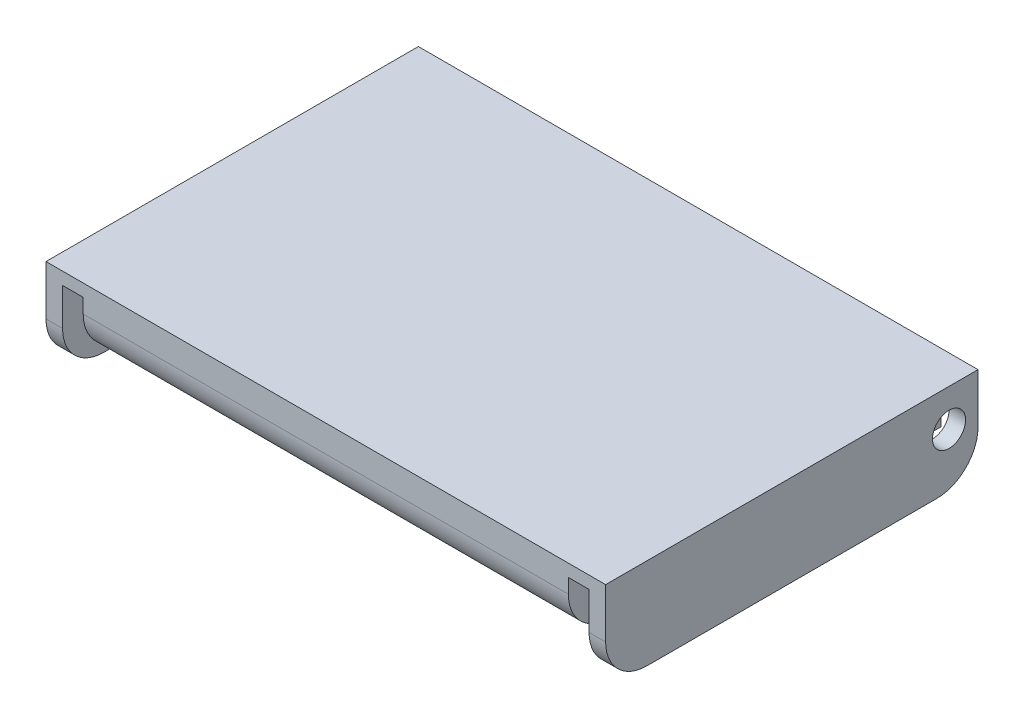
ISO-10303-21;
HEADER;
FILE_DESCRIPTION(('STEP AP214'),'2;1');
FILE_NAME('part.step','',(''),(''),'','','');
FILE_SCHEMA(('AUTOMOTIVE_DESIGN { 1 0 10303 214 1 1 1 1 }'));
ENDSEC;
DATA;
#1=APPLICATION_CONTEXT('core data for automotive mechanical design processes');
#2=APPLICATION_PROTOCOL_DEFINITION('international standard','automotive_design',2000,#1);
#3=PRODUCT_CONTEXT('',#1,'mechanical');
#4=PRODUCT('Part','Part','',(#3));
#5=PRODUCT_RELATED_PRODUCT_CATEGORY('part','',(#4));
#6=PRODUCT_DEFINITION_FORMATION('','',#4);
#7=PRODUCT_DEFINITION_CONTEXT('part definition',#1,'design');
#8=PRODUCT_DEFINITION('design','',#6,#7);
#9=PRODUCT_DEFINITION_SHAPE('','',#8);
#10=(LENGTH_UNIT() NAMED_UNIT(*) SI_UNIT(.MILLI.,.METRE.));
#11=(NAMED_UNIT(*) PLANE_ANGLE_UNIT() SI_UNIT($,.RADIAN.));
#12=(NAMED_UNIT(*) SI_UNIT($,.STERADIAN.) SOLID_ANGLE_UNIT());
#13=UNCERTAINTY_MEASURE_WITH_UNIT(LENGTH_MEASURE(1.E-05),#10,'distance_accuracy_value','');
#14=(GEOMETRIC_REPRESENTATION_CONTEXT(3) GLOBAL_UNCERTAINTY_ASSIGNED_CONTEXT((#13)) GLOBAL_UNIT_ASSIGNED_CONTEXT((#10,
#11,#12)) REPRESENTATION_CONTEXT('',''));
#15=CARTESIAN_POINT('',(0.,0.,0.));
#16=DIRECTION('',(0.,0.,1.));
#17=DIRECTION('',(1.,0.,0.));
#18=AXIS2_PLACEMENT_3D('',#15,#16,#17);
#19=CARTESIAN_POINT('',(0.,10.,-35.));
#20=DIRECTION('',(-1.,0.,0.));
#21=DIRECTION('',(0.,0.,1.));
#22=AXIS2_PLACEMENT_3D('',#19,#20,#21);
#23=CYLINDRICAL_SURFACE('',#22,10.);
#24=CARTESIAN_POINT('',(63.625,10.,-35.));
#25=DIRECTION('',(1.,0.,0.));
#26=DIRECTION('',(0.,0.,-1.));
#27=AXIS2_PLACEMENT_3D('',#24,#25,#26);
#28=CIRCLE('',#27,10.);
#29=CARTESIAN_POINT('',(63.625,10.,-45.));
#30=VERTEX_POINT('',#29);
#31=CARTESIAN_POINT('',(63.625,0.,-35.));
#32=VERTEX_POINT('',#31);
#33=EDGE_CURVE('E334',#30,#32,#28,.F.);
#34=ORIENTED_EDGE('',*,*,#33,.F.);
#35=DIRECTION('',(1.,0.,0.));
#36=VECTOR('',#35,1.);
#37=CARTESIAN_POINT('',(0.,10.,-45.));
#38=LINE('',#37,#36);
#39=CARTESIAN_POINT('',(67.625,10.,-45.));
#40=VERTEX_POINT('',#39);
#41=EDGE_CURVE('E48',#40,#30,#38,.F.);
#42=ORIENTED_EDGE('',*,*,#41,.F.);
#43=CARTESIAN_POINT('',(67.625,10.,-35.));
#44=DIRECTION('',(-1.,0.,0.));
#45=DIRECTION('',(0.,0.,1.));
#46=AXIS2_PLACEMENT_3D('',#43,#44,#45);
#47=CIRCLE('',#46,10.);
#48=CARTESIAN_POINT('',(67.625,0.,-35.));
#49=VERTEX_POINT('',#48);
#50=EDGE_CURVE('E11',#49,#40,#47,.F.);
#51=ORIENTED_EDGE('',*,*,#50,.F.);
#52=DIRECTION('',(1.,0.,0.));
#53=VECTOR('',#52,1.);
#54=CARTESIAN_POINT('',(0.,0.,-35.));
#55=LINE('',#54,#53);
#56=EDGE_CURVE('E338',#32,#49,#55,.T.);
#57=ORIENTED_EDGE('',*,*,#56,.F.);
#58=EDGE_LOOP('',(#34,#42,#51,#57));
#59=FACE_BOUND('',#58,.T.);
#60=ADVANCED_FACE('F39',(#59),#23,.T.);
#61=CARTESIAN_POINT('',(0.,10.,-35.));
#62=DIRECTION('',(-1.,0.,0.));
#63=DIRECTION('',(0.,0.,1.));
#64=AXIS2_PLACEMENT_3D('',#61,#62,#63);
#65=CYLINDRICAL_SURFACE('',#64,10.);
#66=DIRECTION('',(1.,0.,0.));
#67=VECTOR('',#66,1.);
#68=CARTESIAN_POINT('',(0.,0.,-35.));
#69=LINE('',#68,#67);
#70=CARTESIAN_POINT('',(-67.625,0.,-35.));
#71=VERTEX_POINT('',#70);
#72=CARTESIAN_POINT('',(-63.625,0.,-35.));
#73=VERTEX_POINT('',#72);
#74=EDGE_CURVE('E319',#71,#73,#69,.T.);
#75=ORIENTED_EDGE('',*,*,#74,.F.);
#76=CARTESIAN_POINT('',(-67.625,10.,-35.));
#77=DIRECTION('',(1.,0.,0.));
#78=DIRECTION('',(0.,0.,-1.));
#79=AXIS2_PLACEMENT_3D('',#76,#77,#78);
#80=CIRCLE('',#79,10.);
#81=CARTESIAN_POINT('',(-67.625,10.,-45.));
#82=VERTEX_POINT('',#81);
#83=EDGE_CURVE('E331',#82,#71,#80,.F.);
#84=ORIENTED_EDGE('',*,*,#83,.F.);
#85=DIRECTION('',(1.,0.,0.));
#86=VECTOR('',#85,1.);
#87=CARTESIAN_POINT('',(0.,10.,-45.));
#88=LINE('',#87,#86);
#89=CARTESIAN_POINT('',(-63.625,10.,-45.));
#90=VERTEX_POINT('',#89);
#91=EDGE_CURVE('E327',#90,#82,#88,.F.);
#92=ORIENTED_EDGE('',*,*,#91,.F.);
#93=CARTESIAN_POINT('',(-63.625,10.,-35.));
#94=DIRECTION('',(-1.,0.,0.));
#95=DIRECTION('',(0.,0.,1.));
#96=AXIS2_PLACEMENT_3D('',#93,#94,#95);
#97=CIRCLE('',#96,10.);
#98=EDGE_CURVE('E323',#73,#90,#97,.F.);
#99=ORIENTED_EDGE('',*,*,#98,.F.);
#100=EDGE_LOOP('',(#75,#84,#92,#99));
#101=FACE_BOUND('',#100,.T.);
#102=ADVANCED_FACE('F403',(#101),#65,.T.);
#103=CARTESIAN_POINT('',(0.,10.,35.));
#104=DIRECTION('',(1.,0.,0.));
#105=DIRECTION('',(0.,0.,-1.));
#106=AXIS2_PLACEMENT_3D('',#103,#104,#105);
#107=CYLINDRICAL_SURFACE('',#106,10.);
#108=DIRECTION('',(-1.,0.,0.));
#109=VECTOR('',#108,1.);
#110=CARTESIAN_POINT('',(0.,0.,35.));
#111=LINE('',#110,#109);
#112=CARTESIAN_POINT('',(67.625,0.,35.));
#113=VERTEX_POINT('',#112);
#114=CARTESIAN_POINT('',(63.625,0.,35.));
#115=VERTEX_POINT('',#114);
#116=EDGE_CURVE('E305',#113,#115,#111,.T.);
#117=ORIENTED_EDGE('',*,*,#116,.F.);
#118=CARTESIAN_POINT('',(67.625,10.,35.));
#119=DIRECTION('',(-1.,0.,0.));
#120=DIRECTION('',(0.,0.,1.));
#121=AXIS2_PLACEMENT_3D('',#118,#119,#120);
#122=CIRCLE('',#121,10.);
#123=CARTESIAN_POINT('',(67.625,10.,45.));
#124=VERTEX_POINT('',#123);
#125=EDGE_CURVE('E313',#124,#113,#122,.F.);
#126=ORIENTED_EDGE('',*,*,#125,.F.);
#127=DIRECTION('',(-1.,0.,0.));
#128=VECTOR('',#127,1.);
#129=CARTESIAN_POINT('',(0.,10.,45.));
#130=LINE('',#129,#128);
#131=CARTESIAN_POINT('',(63.625,10.,45.));
#132=VERTEX_POINT('',#131);
#133=EDGE_CURVE('E309',#132,#124,#130,.F.);
#134=ORIENTED_EDGE('',*,*,#133,.F.);
#135=CARTESIAN_POINT('',(63.625,10.,35.));
#136=DIRECTION('',(1.,0.,0.));
#137=DIRECTION('',(0.,0.,-1.));
#138=AXIS2_PLACEMENT_3D('',#135,#136,#137);
#139=CIRCLE('',#138,10.);
#140=EDGE_CURVE('E316',#115,#132,#139,.F.);
#141=ORIENTED_EDGE('',*,*,#140,.F.);
#142=EDGE_LOOP('',(#117,#126,#134,#141));
#143=FACE_BOUND('',#142,.T.);
#144=ADVANCED_FACE('F407',(#143),#107,.T.);
#145=CARTESIAN_POINT('',(0.,10.,35.));
#146=DIRECTION('',(1.,0.,0.));
#147=DIRECTION('',(0.,0.,-1.));
#148=AXIS2_PLACEMENT_3D('',#145,#146,#147);
#149=CYLINDRICAL_SURFACE('',#148,10.);
#150=CARTESIAN_POINT('',(-63.625,10.,35.));
#151=DIRECTION('',(-1.,0.,0.));
#152=DIRECTION('',(0.,0.,1.));
#153=AXIS2_PLACEMENT_3D('',#150,#151,#152);
#154=CIRCLE('',#153,10.);
#155=CARTESIAN_POINT('',(-63.625,10.,45.));
#156=VERTEX_POINT('',#155);
#157=CARTESIAN_POINT('',(-63.625,0.,35.));
#158=VERTEX_POINT('',#157);
#159=EDGE_CURVE('E291',#156,#158,#154,.F.);
#160=ORIENTED_EDGE('',*,*,#159,.F.);
#161=DIRECTION('',(-1.,0.,0.));
#162=VECTOR('',#161,1.);
#163=CARTESIAN_POINT('',(0.,10.,45.));
#164=LINE('',#163,#162);
#165=CARTESIAN_POINT('',(-67.625,10.,45.));
#166=VERTEX_POINT('',#165);
#167=EDGE_CURVE('E299',#166,#156,#164,.F.);
#168=ORIENTED_EDGE('',*,*,#167,.F.);
#169=CARTESIAN_POINT('',(-67.625,10.,35.));
#170=DIRECTION('',(1.,0.,0.));
#171=DIRECTION('',(0.,0.,-1.));
#172=AXIS2_PLACEMENT_3D('',#169,#170,#171);
#173=CIRCLE('',#172,10.);
#174=CARTESIAN_POINT('',(-67.625,0.,35.));
#175=VERTEX_POINT('',#174);
#176=EDGE_CURVE('E302',#175,#166,#173,.F.);
#177=ORIENTED_EDGE('',*,*,#176,.F.);
#178=DIRECTION('',(-1.,0.,0.));
#179=VECTOR('',#178,1.);
#180=CARTESIAN_POINT('',(0.,0.,35.));
#181=LINE('',#180,#179);
#182=EDGE_CURVE('E295',#158,#175,#181,.T.);
#183=ORIENTED_EDGE('',*,*,#182,.F.);
#184=EDGE_LOOP('',(#160,#168,#177,#183));
#185=FACE_BOUND('',#184,.T.);
#186=ADVANCED_FACE('F412',(#185),#149,.T.);
#187=CARTESIAN_POINT('',(-58.625,15.5,35.));
#188=DIRECTION('',(-1.,0.,0.));
#189=DIRECTION('',(0.,0.,1.));
#190=AXIS2_PLACEMENT_3D('',#187,#188,#189);
#191=CYLINDRICAL_SURFACE('',#190,10.);
#192=CARTESIAN_POINT('',(58.625,15.5,35.));
#193=DIRECTION('',(-1.,0.,0.));
#194=DIRECTION('',(0.,0.,1.));
#195=AXIS2_PLACEMENT_3D('',#192,#193,#194);
#196=CIRCLE('',#195,10.);
#197=CARTESIAN_POINT('',(58.625,15.5,45.));
#198=VERTEX_POINT('',#197);
#199=CARTESIAN_POINT('',(58.625,5.5,35.));
#200=VERTEX_POINT('',#199);
#201=EDGE_CURVE('E279',#198,#200,#196,.F.);
#202=ORIENTED_EDGE('',*,*,#201,.F.);
#203=DIRECTION('',(-1.,0.,0.));
#204=VECTOR('',#203,1.);
#205=CARTESIAN_POINT('',(67.625,15.5,45.));
#206=LINE('',#205,#204);
#207=CARTESIAN_POINT('',(-58.625,15.5,45.));
#208=VERTEX_POINT('',#207);
#209=EDGE_CURVE('E288',#208,#198,#206,.F.);
#210=ORIENTED_EDGE('',*,*,#209,.F.);
#211=CARTESIAN_POINT('',(-58.625,15.5,35.));
#212=DIRECTION('',(1.,0.,0.));
#213=DIRECTION('',(0.,0.,-1.));
#214=AXIS2_PLACEMENT_3D('',#211,#212,#213);
#215=CIRCLE('',#214,10.);
#216=CARTESIAN_POINT('',(-58.625,5.5,35.));
#217=VERTEX_POINT('',#216);
#218=EDGE_CURVE('E285',#217,#208,#215,.F.);
#219=ORIENTED_EDGE('',*,*,#218,.F.);
#220=DIRECTION('',(-1.,0.,0.));
#221=VECTOR('',#220,1.);
#222=CARTESIAN_POINT('',(-58.625,5.5,35.));
#223=LINE('',#222,#221);
#224=EDGE_CURVE('E163',#200,#217,#223,.T.);
#225=ORIENTED_EDGE('',*,*,#224,.F.);
#226=EDGE_LOOP('',(#202,#210,#219,#225));
#227=FACE_BOUND('',#226,.T.);
#228=ADVANCED_FACE('F419',(#227),#191,.T.);
#229=CARTESIAN_POINT('',(0.,0.,0.));
#230=DIRECTION('',(0.,-1.,0.));
#231=DIRECTION('',(0.,0.,-1.));
#232=AXIS2_PLACEMENT_3D('',#229,#230,#231);
#233=PLANE('',#232);
#234=DIRECTION('',(0.,0.,1.));
#235=VECTOR('',#234,1.);
#236=CARTESIAN_POINT('',(63.625,0.,-45.));
#237=LINE('',#236,#235);
#238=EDGE_CURVE('E205',#32,#115,#237,.T.);
#239=ORIENTED_EDGE('',*,*,#238,.F.);
#240=ORIENTED_EDGE('',*,*,#56,.T.);
#241=DIRECTION('',(0.,0.,-1.));
#242=VECTOR('',#241,1.);
#243=CARTESIAN_POINT('',(67.625,0.,-45.));
#244=LINE('',#243,#242);
#245=EDGE_CURVE('E251',#113,#49,#244,.T.);
#246=ORIENTED_EDGE('',*,*,#245,.F.);
#247=ORIENTED_EDGE('',*,*,#116,.T.);
#248=EDGE_LOOP('',(#239,#240,#246,#247));
#249=FACE_BOUND('',#248,.T.);
#250=ADVANCED_FACE('F423',(#249),#233,.T.);
#251=CARTESIAN_POINT('',(-67.625,22.,-45.));
#252=DIRECTION('',(1.,0.,0.));
#253=DIRECTION('',(0.,0.,-1.));
#254=AXIS2_PLACEMENT_3D('',#251,#252,#253);
#255=PLANE('',#254);
#256=CARTESIAN_POINT('',(-67.625,13.,-38.));
#257=DIRECTION('',(-1.,0.,0.));
#258=DIRECTION('',(0.,0.,1.));
#259=AXIS2_PLACEMENT_3D('',#256,#257,#258);
#260=CIRCLE('',#259,4.);
#261=CARTESIAN_POINT('',(-67.625,13.,-34.));
#262=VERTEX_POINT('',#261);
#263=EDGE_CURVE('E371',#262,#262,#260,.T.);
#264=ORIENTED_EDGE('',*,*,#263,.F.);
#265=EDGE_LOOP('',(#264));
#266=FACE_BOUND('',#265,.T.);
#267=DIRECTION('',(0.,-1.,0.));
#268=VECTOR('',#267,1.);
#269=CARTESIAN_POINT('',(-67.625,22.,-45.));
#270=LINE('',#269,#268);
#271=CARTESIAN_POINT('',(-67.625,22.,-45.));
#272=VERTEX_POINT('',#271);
#273=EDGE_CURVE('E260',#272,#82,#270,.T.);
#274=ORIENTED_EDGE('',*,*,#273,.T.);
#275=ORIENTED_EDGE('',*,*,#83,.T.);
#276=DIRECTION('',(0.,0.,1.));
#277=VECTOR('',#276,1.);
#278=CARTESIAN_POINT('',(-67.625,0.,-45.));
#279=LINE('',#278,#277);
#280=EDGE_CURVE('E212',#71,#175,#279,.T.);
#281=ORIENTED_EDGE('',*,*,#280,.T.);
#282=ORIENTED_EDGE('',*,*,#176,.T.);
#283=DIRECTION('',(0.,-1.,0.));
#284=VECTOR('',#283,1.);
#285=CARTESIAN_POINT('',(-67.625,22.,45.));
#286=LINE('',#285,#284);
#287=CARTESIAN_POINT('',(-67.625,22.,45.));
#288=VERTEX_POINT('',#287);
#289=EDGE_CURVE('E275',#288,#166,#286,.T.);
#290=ORIENTED_EDGE('',*,*,#289,.F.);
#291=DIRECTION('',(0.,0.,1.));
#292=VECTOR('',#291,1.);
#293=CARTESIAN_POINT('',(-67.625,22.,-45.));
#294=LINE('',#293,#292);
#295=EDGE_CURVE('E246',#272,#288,#294,.T.);
#296=ORIENTED_EDGE('',*,*,#295,.F.);
#297=EDGE_LOOP('',(#274,#275,#281,#282,#290,#296));
#298=FACE_BOUND('',#297,.T.);
#299=ADVANCED_FACE('F425',(#266,#298),#255,.F.);
#300=CARTESIAN_POINT('',(67.625,22.,45.));
#301=DIRECTION('',(0.,0.,-1.));
#302=DIRECTION('',(-1.,0.,0.));
#303=AXIS2_PLACEMENT_3D('',#300,#301,#302);
#304=PLANE('',#303);
#305=DIRECTION('',(0.,1.,0.));
#306=VECTOR('',#305,1.);
#307=CARTESIAN_POINT('',(63.625,19.,45.));
#308=LINE('',#307,#306);
#309=CARTESIAN_POINT('',(63.625,19.,45.));
#310=VERTEX_POINT('',#309);
#311=EDGE_CURVE('E228',#132,#310,#308,.T.);
#312=ORIENTED_EDGE('',*,*,#311,.F.);
#313=ORIENTED_EDGE('',*,*,#133,.T.);
#314=DIRECTION('',(0.,-1.,0.));
#315=VECTOR('',#314,1.);
#316=CARTESIAN_POINT('',(67.625,22.,45.));
#317=LINE('',#316,#315);
#318=CARTESIAN_POINT('',(67.625,22.,45.));
#319=VERTEX_POINT('',#318);
#320=EDGE_CURVE('E271',#319,#124,#317,.T.);
#321=ORIENTED_EDGE('',*,*,#320,.F.);
#322=DIRECTION('',(1.,0.,0.));
#323=VECTOR('',#322,1.);
#324=CARTESIAN_POINT('',(67.625,22.,45.));
#325=LINE('',#324,#323);
#326=EDGE_CURVE('E250',#288,#319,#325,.T.);
#327=ORIENTED_EDGE('',*,*,#326,.F.);
#328=ORIENTED_EDGE('',*,*,#289,.T.);
#329=ORIENTED_EDGE('',*,*,#167,.T.);
#330=DIRECTION('',(0.,-1.,0.));
#331=VECTOR('',#330,1.);
#332=CARTESIAN_POINT('',(-63.625,19.,45.));
#333=LINE('',#332,#331);
#334=CARTESIAN_POINT('',(-63.625,19.,45.));
#335=VERTEX_POINT('',#334);
#336=EDGE_CURVE('E188',#335,#156,#333,.T.);
#337=ORIENTED_EDGE('',*,*,#336,.F.);
#338=DIRECTION('',(-1.,0.,0.));
#339=VECTOR('',#338,1.);
#340=CARTESIAN_POINT('',(-63.625,19.,45.));
#341=LINE('',#340,#339);
#342=CARTESIAN_POINT('',(-58.625,19.,45.));
#343=VERTEX_POINT('',#342);
#344=EDGE_CURVE('E195',#343,#335,#341,.T.);
#345=ORIENTED_EDGE('',*,*,#344,.F.);
#346=DIRECTION('',(0.,1.,0.));
#347=VECTOR('',#346,1.);
#348=CARTESIAN_POINT('',(-58.625,19.,45.));
#349=LINE('',#348,#347);
#350=EDGE_CURVE('E202',#208,#343,#349,.T.);
#351=ORIENTED_EDGE('',*,*,#350,.F.);
#352=ORIENTED_EDGE('',*,*,#209,.T.);
#353=DIRECTION('',(0.,-1.,0.));
#354=VECTOR('',#353,1.);
#355=CARTESIAN_POINT('',(58.625,19.,45.));
#356=LINE('',#355,#354);
#357=CARTESIAN_POINT('',(58.625,19.,45.));
#358=VERTEX_POINT('',#357);
#359=EDGE_CURVE('E222',#358,#198,#356,.T.);
#360=ORIENTED_EDGE('',*,*,#359,.F.);
#361=DIRECTION('',(-1.,0.,0.));
#362=VECTOR('',#361,1.);
#363=CARTESIAN_POINT('',(63.625,19.,45.));
#364=LINE('',#363,#362);
#365=EDGE_CURVE('E231',#310,#358,#364,.T.);
#366=ORIENTED_EDGE('',*,*,#365,.F.);
#367=EDGE_LOOP('',(#312,#313,#321,#327,#328,#329,#337,#345,#351,#352,#360,#366));
#368=FACE_BOUND('',#367,.T.);
#369=ADVANCED_FACE('F428',(#368),#304,.F.);
#370=CARTESIAN_POINT('',(67.625,22.,-45.));
#371=DIRECTION('',(-1.,0.,0.));
#372=DIRECTION('',(0.,0.,1.));
#373=AXIS2_PLACEMENT_3D('',#370,#371,#372);
#374=PLANE('',#373);
#375=CARTESIAN_POINT('',(67.625,13.,-38.));
#376=DIRECTION('',(-1.,0.,0.));
#377=DIRECTION('',(0.,0.,1.));
#378=AXIS2_PLACEMENT_3D('',#375,#376,#377);
#379=CIRCLE('',#378,4.);
#380=CARTESIAN_POINT('',(67.625,13.,-34.));
#381=VERTEX_POINT('',#380);
#382=EDGE_CURVE('E375',#381,#381,#379,.T.);
#383=ORIENTED_EDGE('',*,*,#382,.T.);
#384=EDGE_LOOP('',(#383));
#385=FACE_BOUND('',#384,.T.);
#386=ORIENTED_EDGE('',*,*,#245,.T.);
#387=ORIENTED_EDGE('',*,*,#50,.T.);
#388=DIRECTION('',(0.,-1.,0.));
#389=VECTOR('',#388,1.);
#390=CARTESIAN_POINT('',(67.625,22.,-45.));
#391=LINE('',#390,#389);
#392=CARTESIAN_POINT('',(67.625,22.,-45.));
#393=VERTEX_POINT('',#392);
#394=EDGE_CURVE('E268',#393,#40,#391,.T.);
#395=ORIENTED_EDGE('',*,*,#394,.F.);
#396=DIRECTION('',(0.,0.,-1.));
#397=VECTOR('',#396,1.);
#398=CARTESIAN_POINT('',(67.625,22.,-45.));
#399=LINE('',#398,#397);
#400=EDGE_CURVE('E254',#319,#393,#399,.T.);
#401=ORIENTED_EDGE('',*,*,#400,.F.);
#402=ORIENTED_EDGE('',*,*,#320,.T.);
#403=ORIENTED_EDGE('',*,*,#125,.T.);
#404=EDGE_LOOP('',(#386,#387,#395,#401,#402,#403));
#405=FACE_BOUND('',#404,.T.);
#406=ADVANCED_FACE('F432',(#385,#405),#374,.F.);
#407=CARTESIAN_POINT('',(67.625,22.,-45.));
#408=DIRECTION('',(0.,0.,1.));
#409=DIRECTION('',(1.,0.,0.));
#410=AXIS2_PLACEMENT_3D('',#407,#408,#409);
#411=PLANE('',#410);
#412=ORIENTED_EDGE('',*,*,#394,.T.);
#413=ORIENTED_EDGE('',*,*,#41,.T.);
#414=DIRECTION('',(0.,1.,0.));
#415=VECTOR('',#414,1.);
#416=CARTESIAN_POINT('',(63.625,19.,-45.));
#417=LINE('',#416,#415);
#418=CARTESIAN_POINT('',(63.625,19.,-45.));
#419=VERTEX_POINT('',#418);
#420=EDGE_CURVE('E218',#30,#419,#417,.T.);
#421=ORIENTED_EDGE('',*,*,#420,.T.);
#422=DIRECTION('',(-1.,0.,0.));
#423=VECTOR('',#422,1.);
#424=CARTESIAN_POINT('',(63.625,19.,-45.));
#425=LINE('',#424,#423);
#426=CARTESIAN_POINT('',(58.625,19.,-45.));
#427=VERTEX_POINT('',#426);
#428=EDGE_CURVE('E221',#419,#427,#425,.T.);
#429=ORIENTED_EDGE('',*,*,#428,.T.);
#430=DIRECTION('',(0.,-1.,0.));
#431=VECTOR('',#430,1.);
#432=CARTESIAN_POINT('',(58.625,19.,-45.));
#433=LINE('',#432,#431);
#434=CARTESIAN_POINT('',(58.625,5.5,-45.));
#435=VERTEX_POINT('',#434);
#436=EDGE_CURVE('E178',#427,#435,#433,.T.);
#437=ORIENTED_EDGE('',*,*,#436,.T.);
#438=DIRECTION('',(1.,0.,0.));
#439=VECTOR('',#438,1.);
#440=CARTESIAN_POINT('',(-58.625,5.5,-45.));
#441=LINE('',#440,#439);
#442=CARTESIAN_POINT('',(-58.625,5.5,-45.));
#443=VERTEX_POINT('',#442);
#444=EDGE_CURVE('E161',#443,#435,#441,.T.);
#445=ORIENTED_EDGE('',*,*,#444,.F.);
#446=DIRECTION('',(0.,1.,0.));
#447=VECTOR('',#446,1.);
#448=CARTESIAN_POINT('',(-58.625,19.,-45.));
#449=LINE('',#448,#447);
#450=CARTESIAN_POINT('',(-58.625,19.,-45.));
#451=VERTEX_POINT('',#450);
#452=EDGE_CURVE('E174',#443,#451,#449,.T.);
#453=ORIENTED_EDGE('',*,*,#452,.T.);
#454=DIRECTION('',(-1.,0.,0.));
#455=VECTOR('',#454,1.);
#456=CARTESIAN_POINT('',(-63.625,19.,-45.));
#457=LINE('',#456,#455);
#458=CARTESIAN_POINT('',(-63.625,19.,-45.));
#459=VERTEX_POINT('',#458);
#460=EDGE_CURVE('E187',#451,#459,#457,.T.);
#461=ORIENTED_EDGE('',*,*,#460,.T.);
#462=DIRECTION('',(0.,-1.,0.));
#463=VECTOR('',#462,1.);
#464=CARTESIAN_POINT('',(-63.625,19.,-45.));
#465=LINE('',#464,#463);
#466=EDGE_CURVE('E192',#459,#90,#465,.T.);
#467=ORIENTED_EDGE('',*,*,#466,.T.);
#468=ORIENTED_EDGE('',*,*,#91,.T.);
#469=ORIENTED_EDGE('',*,*,#273,.F.);
#470=DIRECTION('',(-1.,0.,0.));
#471=VECTOR('',#470,1.);
#472=CARTESIAN_POINT('',(67.625,22.,-45.));
#473=LINE('',#472,#471);
#474=EDGE_CURVE('E257',#393,#272,#473,.T.);
#475=ORIENTED_EDGE('',*,*,#474,.F.);
#476=EDGE_LOOP('',(#412,#413,#421,#429,#437,#445,#453,#461,#467,#468,#469,#475));
#477=FACE_BOUND('',#476,.T.);
#478=ADVANCED_FACE('F172',(#477),#411,.F.);
#479=CARTESIAN_POINT('',(0.,22.,0.));
#480=DIRECTION('',(0.,-1.,0.));
#481=DIRECTION('',(0.,0.,-1.));
#482=AXIS2_PLACEMENT_3D('',#479,#480,#481);
#483=PLANE('',#482);
#484=ORIENTED_EDGE('',*,*,#295,.T.);
#485=ORIENTED_EDGE('',*,*,#326,.T.);
#486=ORIENTED_EDGE('',*,*,#400,.T.);
#487=ORIENTED_EDGE('',*,*,#474,.T.);
#488=EDGE_LOOP('',(#484,#485,#486,#487));
#489=FACE_BOUND('',#488,.T.);
#490=ADVANCED_FACE('F438',(#489),#483,.F.);
#491=ORIENTED_EDGE('',*,*,#280,.F.);
#492=ORIENTED_EDGE('',*,*,#74,.T.);
#493=DIRECTION('',(0.,0.,1.));
#494=VECTOR('',#493,1.);
#495=CARTESIAN_POINT('',(-63.625,0.,-45.));
#496=LINE('',#495,#494);
#497=EDGE_CURVE('E209',#73,#158,#496,.T.);
#498=ORIENTED_EDGE('',*,*,#497,.T.);
#499=ORIENTED_EDGE('',*,*,#182,.T.);
#500=EDGE_LOOP('',(#491,#492,#498,#499));
#501=FACE_BOUND('',#500,.T.);
#502=ADVANCED_FACE('F439',(#501),#233,.T.);
#503=CARTESIAN_POINT('',(63.625,19.,-45.));
#504=DIRECTION('',(1.,0.,0.));
#505=DIRECTION('',(0.,0.,-1.));
#506=AXIS2_PLACEMENT_3D('',#503,#504,#505);
#507=PLANE('',#506);
#508=CARTESIAN_POINT('',(63.625,13.,-38.));
#509=DIRECTION('',(1.,0.,0.));
#510=DIRECTION('',(0.,0.,-1.));
#511=AXIS2_PLACEMENT_3D('',#508,#509,#510);
#512=CIRCLE('',#511,4.);
#513=CARTESIAN_POINT('',(63.625,13.,-42.));
#514=VERTEX_POINT('',#513);
#515=EDGE_CURVE('E180',#514,#514,#512,.T.);
#516=ORIENTED_EDGE('',*,*,#515,.T.);
#517=EDGE_LOOP('',(#516));
#518=FACE_BOUND('',#517,.T.);
#519=ORIENTED_EDGE('',*,*,#420,.F.);
#520=ORIENTED_EDGE('',*,*,#33,.T.);
#521=ORIENTED_EDGE('',*,*,#238,.T.);
#522=ORIENTED_EDGE('',*,*,#140,.T.);
#523=ORIENTED_EDGE('',*,*,#311,.T.);
#524=DIRECTION('',(0.,0.,1.));
#525=VECTOR('',#524,1.);
#526=CARTESIAN_POINT('',(63.625,19.,-45.));
#527=LINE('',#526,#525);
#528=EDGE_CURVE('E227',#419,#310,#527,.T.);
#529=ORIENTED_EDGE('',*,*,#528,.F.);
#530=EDGE_LOOP('',(#519,#520,#521,#522,#523,#529));
#531=FACE_BOUND('',#530,.T.);
#532=ADVANCED_FACE('F348',(#518,#531),#507,.F.);
#533=CARTESIAN_POINT('',(58.625,19.,-45.));
#534=DIRECTION('',(-1.,0.,0.));
#535=DIRECTION('',(0.,0.,1.));
#536=AXIS2_PLACEMENT_3D('',#533,#534,#535);
#537=PLANE('',#536);
#538=CARTESIAN_POINT('',(58.625,13.,-38.));
#539=DIRECTION('',(-1.,0.,0.));
#540=DIRECTION('',(0.,0.,1.));
#541=AXIS2_PLACEMENT_3D('',#538,#539,#540);
#542=CIRCLE('',#541,4.);
#543=CARTESIAN_POINT('',(58.625,13.,-34.));
#544=VERTEX_POINT('',#543);
#545=EDGE_CURVE('E363',#544,#544,#542,.T.);
#546=ORIENTED_EDGE('',*,*,#545,.T.);
#547=EDGE_LOOP('',(#546));
#548=FACE_BOUND('',#547,.T.);
#549=ORIENTED_EDGE('',*,*,#359,.T.);
#550=ORIENTED_EDGE('',*,*,#201,.T.);
#551=DIRECTION('',(0.,0.,-1.));
#552=VECTOR('',#551,1.);
#553=CARTESIAN_POINT('',(58.625,5.5,45.));
#554=LINE('',#553,#552);
#555=EDGE_CURVE('E168',#200,#435,#554,.T.);
#556=ORIENTED_EDGE('',*,*,#555,.T.);
#557=ORIENTED_EDGE('',*,*,#436,.F.);
#558=DIRECTION('',(0.,0.,1.));
#559=VECTOR('',#558,1.);
#560=CARTESIAN_POINT('',(58.625,19.,-45.));
#561=LINE('',#560,#559);
#562=EDGE_CURVE('E240',#427,#358,#561,.T.);
#563=ORIENTED_EDGE('',*,*,#562,.T.);
#564=EDGE_LOOP('',(#549,#550,#556,#557,#563));
#565=FACE_BOUND('',#564,.T.);
#566=ADVANCED_FACE('F356',(#548,#565),#537,.F.);
#567=CARTESIAN_POINT('',(63.625,19.,-45.));
#568=DIRECTION('',(0.,1.,0.));
#569=DIRECTION('',(0.,0.,1.));
#570=AXIS2_PLACEMENT_3D('',#567,#568,#569);
#571=PLANE('',#570);
#572=ORIENTED_EDGE('',*,*,#365,.T.);
#573=ORIENTED_EDGE('',*,*,#562,.F.);
#574=ORIENTED_EDGE('',*,*,#428,.F.);
#575=ORIENTED_EDGE('',*,*,#528,.T.);
#576=EDGE_LOOP('',(#572,#573,#574,#575));
#577=FACE_BOUND('',#576,.T.);
#578=ADVANCED_FACE('F353',(#577),#571,.F.);
#579=CARTESIAN_POINT('',(-58.625,19.,-45.));
#580=DIRECTION('',(1.,0.,0.));
#581=DIRECTION('',(0.,0.,-1.));
#582=AXIS2_PLACEMENT_3D('',#579,#580,#581);
#583=PLANE('',#582);
#584=CARTESIAN_POINT('',(-58.625,13.,-38.));
#585=DIRECTION('',(1.,0.,0.));
#586=DIRECTION('',(0.,0.,-1.));
#587=AXIS2_PLACEMENT_3D('',#584,#585,#586);
#588=CIRCLE('',#587,4.);
#589=CARTESIAN_POINT('',(-58.625,13.,-42.));
#590=VERTEX_POINT('',#589);
#591=EDGE_CURVE('E367',#590,#590,#588,.T.);
#592=ORIENTED_EDGE('',*,*,#591,.T.);
#593=EDGE_LOOP('',(#592));
#594=FACE_BOUND('',#593,.T.);
#595=DIRECTION('',(0.,0.,-1.));
#596=VECTOR('',#595,1.);
#597=CARTESIAN_POINT('',(-58.625,5.5,45.));
#598=LINE('',#597,#596);
#599=EDGE_CURVE('E157',#217,#443,#598,.T.);
#600=ORIENTED_EDGE('',*,*,#599,.F.);
#601=ORIENTED_EDGE('',*,*,#218,.T.);
#602=ORIENTED_EDGE('',*,*,#350,.T.);
#603=DIRECTION('',(0.,0.,1.));
#604=VECTOR('',#603,1.);
#605=CARTESIAN_POINT('',(-58.625,19.,-45.));
#606=LINE('',#605,#604);
#607=EDGE_CURVE('E184',#451,#343,#606,.T.);
#608=ORIENTED_EDGE('',*,*,#607,.F.);
#609=ORIENTED_EDGE('',*,*,#452,.F.);
#610=EDGE_LOOP('',(#600,#601,#602,#608,#609));
#611=FACE_BOUND('',#610,.T.);
#612=ADVANCED_FACE('F182',(#594,#611),#583,.F.);
#613=CARTESIAN_POINT('',(-63.625,19.,-45.));
#614=DIRECTION('',(-1.,0.,0.));
#615=DIRECTION('',(0.,0.,1.));
#616=AXIS2_PLACEMENT_3D('',#613,#614,#615);
#617=PLANE('',#616);
#618=CARTESIAN_POINT('',(-63.625,13.,-38.));
#619=DIRECTION('',(-1.,0.,0.));
#620=DIRECTION('',(0.,0.,1.));
#621=AXIS2_PLACEMENT_3D('',#618,#619,#620);
#622=CIRCLE('',#621,4.);
#623=CARTESIAN_POINT('',(-63.625,13.,-34.));
#624=VERTEX_POINT('',#623);
#625=EDGE_CURVE('E42',#624,#624,#622,.T.);
#626=ORIENTED_EDGE('',*,*,#625,.T.);
#627=EDGE_LOOP('',(#626));
#628=FACE_BOUND('',#627,.T.);
#629=ORIENTED_EDGE('',*,*,#497,.F.);
#630=ORIENTED_EDGE('',*,*,#98,.T.);
#631=ORIENTED_EDGE('',*,*,#466,.F.);
#632=DIRECTION('',(0.,0.,1.));
#633=VECTOR('',#632,1.);
#634=CARTESIAN_POINT('',(-63.625,19.,-45.));
#635=LINE('',#634,#633);
#636=EDGE_CURVE('E213',#459,#335,#635,.T.);
#637=ORIENTED_EDGE('',*,*,#636,.T.);
#638=ORIENTED_EDGE('',*,*,#336,.T.);
#639=ORIENTED_EDGE('',*,*,#159,.T.);
#640=EDGE_LOOP('',(#629,#630,#631,#637,#638,#639));
#641=FACE_BOUND('',#640,.T.);
#642=ADVANCED_FACE('F384',(#628,#641),#617,.F.);
#643=CARTESIAN_POINT('',(-63.625,19.,-45.));
#644=DIRECTION('',(0.,1.,0.));
#645=DIRECTION('',(0.,0.,1.));
#646=AXIS2_PLACEMENT_3D('',#643,#644,#645);
#647=PLANE('',#646);
#648=ORIENTED_EDGE('',*,*,#344,.T.);
#649=ORIENTED_EDGE('',*,*,#636,.F.);
#650=ORIENTED_EDGE('',*,*,#460,.F.);
#651=ORIENTED_EDGE('',*,*,#607,.T.);
#652=EDGE_LOOP('',(#648,#649,#650,#651));
#653=FACE_BOUND('',#652,.T.);
#654=ADVANCED_FACE('F398',(#653),#647,.F.);
#655=CARTESIAN_POINT('',(-58.625,5.5,45.));
#656=DIRECTION('',(0.,1.,0.));
#657=DIRECTION('',(0.,0.,1.));
#658=AXIS2_PLACEMENT_3D('',#655,#656,#657);
#659=PLANE('',#658);
#660=ORIENTED_EDGE('',*,*,#555,.F.);
#661=ORIENTED_EDGE('',*,*,#224,.T.);
#662=ORIENTED_EDGE('',*,*,#599,.T.);
#663=ORIENTED_EDGE('',*,*,#444,.T.);
#664=EDGE_LOOP('',(#660,#661,#662,#663));
#665=FACE_BOUND('',#664,.T.);
#666=ADVANCED_FACE('F160',(#665),#659,.F.);
#667=CARTESIAN_POINT('',(67.625,13.,-38.));
#668=DIRECTION('',(-1.,0.,0.));
#669=DIRECTION('',(0.,0.,1.));
#670=AXIS2_PLACEMENT_3D('',#667,#668,#669);
#671=CYLINDRICAL_SURFACE('',#670,4.);
#672=ORIENTED_EDGE('',*,*,#263,.T.);
#673=EDGE_LOOP('',(#672));
#674=FACE_BOUND('',#673,.T.);
#675=ORIENTED_EDGE('',*,*,#625,.F.);
#676=EDGE_LOOP('',(#675));
#677=FACE_BOUND('',#676,.T.);
#678=ADVANCED_FACE('F387',(#674,#677),#671,.F.);
#679=ORIENTED_EDGE('',*,*,#591,.F.);
#680=EDGE_LOOP('',(#679));
#681=FACE_BOUND('',#680,.T.);
#682=ORIENTED_EDGE('',*,*,#545,.F.);
#683=EDGE_LOOP('',(#682));
#684=FACE_BOUND('',#683,.T.);
#685=ADVANCED_FACE('F389',(#681,#684),#671,.F.);
#686=ORIENTED_EDGE('',*,*,#382,.F.);
#687=EDGE_LOOP('',(#686));
#688=FACE_BOUND('',#687,.T.);
#689=ORIENTED_EDGE('',*,*,#515,.F.);
#690=EDGE_LOOP('',(#689));
#691=FACE_BOUND('',#690,.T.);
#692=ADVANCED_FACE('F392',(#688,#691),#671,.F.);
#693=CLOSED_SHELL('',(#60,#102,#144,#186,#228,#250,#299,#369,#406,#478,#490,#502,#532,#566,#578,
#612,#642,#654,#666,#678,#685,#692));
#694=MANIFOLD_SOLID_BREP('B2',#693);
#695=ADVANCED_BREP_SHAPE_REPRESENTATION('',(#18,#694),#14);
#696=SHAPE_DEFINITION_REPRESENTATION(#9,#695);
ENDSEC;
END-ISO-10303-21;
